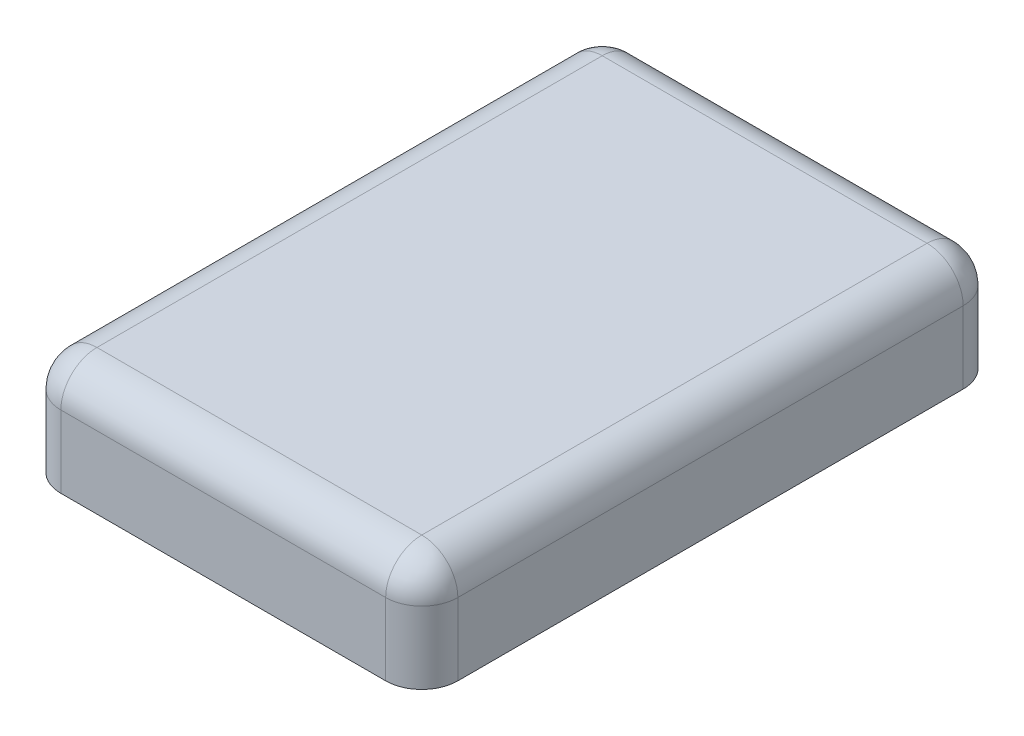
ISO-10303-21;
HEADER;
FILE_DESCRIPTION(('STEP AP214'),'2;1');
FILE_NAME('part.step','',(''),(''),'','','');
FILE_SCHEMA(('AUTOMOTIVE_DESIGN { 1 0 10303 214 1 1 1 1 }'));
ENDSEC;
DATA;
#1=APPLICATION_CONTEXT('core data for automotive mechanical design processes');
#2=APPLICATION_PROTOCOL_DEFINITION('international standard','automotive_design',2000,#1);
#3=PRODUCT_CONTEXT('',#1,'mechanical');
#4=PRODUCT('Part','Part','',(#3));
#5=PRODUCT_RELATED_PRODUCT_CATEGORY('part','',(#4));
#6=PRODUCT_DEFINITION_FORMATION('','',#4);
#7=PRODUCT_DEFINITION_CONTEXT('part definition',#1,'design');
#8=PRODUCT_DEFINITION('design','',#6,#7);
#9=PRODUCT_DEFINITION_SHAPE('','',#8);
#10=(LENGTH_UNIT() NAMED_UNIT(*) SI_UNIT(.MILLI.,.METRE.));
#11=(NAMED_UNIT(*) PLANE_ANGLE_UNIT() SI_UNIT($,.RADIAN.));
#12=(NAMED_UNIT(*) SI_UNIT($,.STERADIAN.) SOLID_ANGLE_UNIT());
#13=UNCERTAINTY_MEASURE_WITH_UNIT(LENGTH_MEASURE(1.E-05),#10,'distance_accuracy_value','');
#14=(GEOMETRIC_REPRESENTATION_CONTEXT(3) GLOBAL_UNCERTAINTY_ASSIGNED_CONTEXT((#13)) GLOBAL_UNIT_ASSIGNED_CONTEXT((#10,
#11,#12)) REPRESENTATION_CONTEXT('',''));
#15=CARTESIAN_POINT('',(0.,0.,0.));
#16=DIRECTION('',(0.,0.,1.));
#17=DIRECTION('',(1.,0.,0.));
#18=AXIS2_PLACEMENT_3D('',#15,#16,#17);
#19=CARTESIAN_POINT('',(1.1,0.6,-1.6));
#20=DIRECTION('',(-1.,0.,0.));
#21=DIRECTION('',(0.,0.,1.));
#22=AXIS2_PLACEMENT_3D('',#19,#20,#21);
#23=PLANE('',#22);
#24=DIRECTION('',(0.,-1.,0.));
#25=VECTOR('',#24,1.);
#26=CARTESIAN_POINT('',(1.1,0.6,-1.4));
#27=LINE('',#26,#25);
#28=CARTESIAN_POINT('',(1.1,0.,-1.4));
#29=VERTEX_POINT('',#28);
#30=CARTESIAN_POINT('',(1.1,0.4,-1.4));
#31=VERTEX_POINT('',#30);
#32=EDGE_CURVE('E120',#29,#31,#27,.F.);
#33=ORIENTED_EDGE('',*,*,#32,.T.);
#34=DIRECTION('',(0.,0.,-1.));
#35=VECTOR('',#34,1.);
#36=CARTESIAN_POINT('',(1.1,0.4,1.4));
#37=LINE('',#36,#35);
#38=CARTESIAN_POINT('',(1.1,0.4,1.4));
#39=VERTEX_POINT('',#38);
#40=EDGE_CURVE('E60',#31,#39,#37,.F.);
#41=ORIENTED_EDGE('',*,*,#40,.T.);
#42=DIRECTION('',(0.,-1.,0.));
#43=VECTOR('',#42,1.);
#44=CARTESIAN_POINT('',(1.1,0.6,1.4));
#45=LINE('',#44,#43);
#46=CARTESIAN_POINT('',(1.1,0.,1.4));
#47=VERTEX_POINT('',#46);
#48=EDGE_CURVE('E113',#39,#47,#45,.T.);
#49=ORIENTED_EDGE('',*,*,#48,.T.);
#50=DIRECTION('',(0.,0.,-1.));
#51=VECTOR('',#50,1.);
#52=CARTESIAN_POINT('',(1.1,0.,-1.6));
#53=LINE('',#52,#51);
#54=EDGE_CURVE('E116',#47,#29,#53,.T.);
#55=ORIENTED_EDGE('',*,*,#54,.T.);
#56=EDGE_LOOP('',(#33,#41,#49,#55));
#57=FACE_BOUND('',#56,.T.);
#58=ADVANCED_FACE('F36',(#57),#23,.F.);
#59=CARTESIAN_POINT('',(-1.1,0.6,-1.6));
#60=DIRECTION('',(0.,0.,1.));
#61=DIRECTION('',(1.,0.,0.));
#62=AXIS2_PLACEMENT_3D('',#59,#60,#61);
#63=PLANE('',#62);
#64=DIRECTION('',(0.,-1.,0.));
#65=VECTOR('',#64,1.);
#66=CARTESIAN_POINT('',(-0.9,0.6,-1.6));
#67=LINE('',#66,#65);
#68=CARTESIAN_POINT('',(-0.9,0.,-1.6));
#69=VERTEX_POINT('',#68);
#70=CARTESIAN_POINT('',(-0.9,0.4,-1.6));
#71=VERTEX_POINT('',#70);
#72=EDGE_CURVE('E153',#69,#71,#67,.F.);
#73=ORIENTED_EDGE('',*,*,#72,.T.);
#74=DIRECTION('',(-1.,0.,0.));
#75=VECTOR('',#74,1.);
#76=CARTESIAN_POINT('',(0.9,0.4,-1.6));
#77=LINE('',#76,#75);
#78=CARTESIAN_POINT('',(0.9,0.4,-1.6));
#79=VERTEX_POINT('',#78);
#80=EDGE_CURVE('E179',#71,#79,#77,.F.);
#81=ORIENTED_EDGE('',*,*,#80,.T.);
#82=DIRECTION('',(0.,-1.,0.));
#83=VECTOR('',#82,1.);
#84=CARTESIAN_POINT('',(0.9,0.6,-1.6));
#85=LINE('',#84,#83);
#86=CARTESIAN_POINT('',(0.9,0.,-1.6));
#87=VERTEX_POINT('',#86);
#88=EDGE_CURVE('E156',#79,#87,#85,.T.);
#89=ORIENTED_EDGE('',*,*,#88,.T.);
#90=DIRECTION('',(-1.,0.,0.));
#91=VECTOR('',#90,1.);
#92=CARTESIAN_POINT('',(-1.1,0.,-1.6));
#93=LINE('',#92,#91);
#94=EDGE_CURVE('E134',#87,#69,#93,.T.);
#95=ORIENTED_EDGE('',*,*,#94,.T.);
#96=EDGE_LOOP('',(#73,#81,#89,#95));
#97=FACE_BOUND('',#96,.T.);
#98=ADVANCED_FACE('F238',(#97),#63,.F.);
#99=CARTESIAN_POINT('',(-1.1,0.6,-1.6));
#100=DIRECTION('',(1.,0.,0.));
#101=DIRECTION('',(0.,0.,-1.));
#102=AXIS2_PLACEMENT_3D('',#99,#100,#101);
#103=PLANE('',#102);
#104=DIRECTION('',(0.,-1.,0.));
#105=VECTOR('',#104,1.);
#106=CARTESIAN_POINT('',(-1.1,0.6,1.4));
#107=LINE('',#106,#105);
#108=CARTESIAN_POINT('',(-1.1,0.,1.4));
#109=VERTEX_POINT('',#108);
#110=CARTESIAN_POINT('',(-1.1,0.4,1.4));
#111=VERTEX_POINT('',#110);
#112=EDGE_CURVE('E160',#109,#111,#107,.F.);
#113=ORIENTED_EDGE('',*,*,#112,.T.);
#114=DIRECTION('',(0.,0.,1.));
#115=VECTOR('',#114,1.);
#116=CARTESIAN_POINT('',(-1.1,0.4,-1.4));
#117=LINE('',#116,#115);
#118=CARTESIAN_POINT('',(-1.1,0.4,-1.4));
#119=VERTEX_POINT('',#118);
#120=EDGE_CURVE('E175',#111,#119,#117,.F.);
#121=ORIENTED_EDGE('',*,*,#120,.T.);
#122=DIRECTION('',(0.,-1.,0.));
#123=VECTOR('',#122,1.);
#124=CARTESIAN_POINT('',(-1.1,0.6,-1.4));
#125=LINE('',#124,#123);
#126=CARTESIAN_POINT('',(-1.1,0.,-1.4));
#127=VERTEX_POINT('',#126);
#128=EDGE_CURVE('E158',#119,#127,#125,.T.);
#129=ORIENTED_EDGE('',*,*,#128,.T.);
#130=DIRECTION('',(0.,0.,1.));
#131=VECTOR('',#130,1.);
#132=CARTESIAN_POINT('',(-1.1,0.,-1.6));
#133=LINE('',#132,#131);
#134=EDGE_CURVE('E137',#127,#109,#133,.T.);
#135=ORIENTED_EDGE('',*,*,#134,.T.);
#136=EDGE_LOOP('',(#113,#121,#129,#135));
#137=FACE_BOUND('',#136,.T.);
#138=ADVANCED_FACE('F243',(#137),#103,.F.);
#139=CARTESIAN_POINT('',(-1.1,0.6,1.6));
#140=DIRECTION('',(0.,0.,-1.));
#141=DIRECTION('',(-1.,0.,0.));
#142=AXIS2_PLACEMENT_3D('',#139,#140,#141);
#143=PLANE('',#142);
#144=DIRECTION('',(0.,-1.,0.));
#145=VECTOR('',#144,1.);
#146=CARTESIAN_POINT('',(0.9,0.6,1.6));
#147=LINE('',#146,#145);
#148=CARTESIAN_POINT('',(0.9,0.,1.6));
#149=VERTEX_POINT('',#148);
#150=CARTESIAN_POINT('',(0.9,0.4,1.6));
#151=VERTEX_POINT('',#150);
#152=EDGE_CURVE('E124',#149,#151,#147,.F.);
#153=ORIENTED_EDGE('',*,*,#152,.T.);
#154=DIRECTION('',(1.,0.,0.));
#155=VECTOR('',#154,1.);
#156=CARTESIAN_POINT('',(-0.9,0.4,1.6));
#157=LINE('',#156,#155);
#158=CARTESIAN_POINT('',(-0.9,0.4,1.6));
#159=VERTEX_POINT('',#158);
#160=EDGE_CURVE('E11',#151,#159,#157,.F.);
#161=ORIENTED_EDGE('',*,*,#160,.T.);
#162=DIRECTION('',(0.,-1.,0.));
#163=VECTOR('',#162,1.);
#164=CARTESIAN_POINT('',(-0.9,0.6,1.6));
#165=LINE('',#164,#163);
#166=CARTESIAN_POINT('',(-0.9,0.,1.6));
#167=VERTEX_POINT('',#166);
#168=EDGE_CURVE('E128',#159,#167,#165,.T.);
#169=ORIENTED_EDGE('',*,*,#168,.T.);
#170=DIRECTION('',(1.,0.,0.));
#171=VECTOR('',#170,1.);
#172=CARTESIAN_POINT('',(-1.1,0.,1.6));
#173=LINE('',#172,#171);
#174=EDGE_CURVE('E144',#167,#149,#173,.T.);
#175=ORIENTED_EDGE('',*,*,#174,.T.);
#176=EDGE_LOOP('',(#153,#161,#169,#175));
#177=FACE_BOUND('',#176,.T.);
#178=ADVANCED_FACE('F354',(#177),#143,.F.);
#179=CARTESIAN_POINT('',(0.,0.6,0.));
#180=DIRECTION('',(0.,1.,0.));
#181=DIRECTION('',(0.,0.,1.));
#182=AXIS2_PLACEMENT_3D('',#179,#180,#181);
#183=PLANE('',#182);
#184=DIRECTION('',(-1.,0.,0.));
#185=VECTOR('',#184,1.);
#186=CARTESIAN_POINT('',(-0.9,0.6,-1.4));
#187=LINE('',#186,#185);
#188=CARTESIAN_POINT('',(0.9,0.6,-1.4));
#189=VERTEX_POINT('',#188);
#190=CARTESIAN_POINT('',(-0.9,0.6,-1.4));
#191=VERTEX_POINT('',#190);
#192=EDGE_CURVE('E170',#189,#191,#187,.T.);
#193=ORIENTED_EDGE('',*,*,#192,.T.);
#194=DIRECTION('',(0.,0.,1.));
#195=VECTOR('',#194,1.);
#196=CARTESIAN_POINT('',(-0.9,0.6,1.4));
#197=LINE('',#196,#195);
#198=CARTESIAN_POINT('',(-0.9,0.6,1.4));
#199=VERTEX_POINT('',#198);
#200=EDGE_CURVE('E172',#191,#199,#197,.T.);
#201=ORIENTED_EDGE('',*,*,#200,.T.);
#202=DIRECTION('',(1.,0.,0.));
#203=VECTOR('',#202,1.);
#204=CARTESIAN_POINT('',(0.9,0.6,1.4));
#205=LINE('',#204,#203);
#206=CARTESIAN_POINT('',(0.9,0.6,1.4));
#207=VERTEX_POINT('',#206);
#208=EDGE_CURVE('E166',#199,#207,#205,.T.);
#209=ORIENTED_EDGE('',*,*,#208,.T.);
#210=DIRECTION('',(0.,0.,-1.));
#211=VECTOR('',#210,1.);
#212=CARTESIAN_POINT('',(0.9,0.6,-1.4));
#213=LINE('',#212,#211);
#214=EDGE_CURVE('E168',#207,#189,#213,.T.);
#215=ORIENTED_EDGE('',*,*,#214,.T.);
#216=EDGE_LOOP('',(#193,#201,#209,#215));
#217=FACE_BOUND('',#216,.T.);
#218=ADVANCED_FACE('F215',(#217),#183,.T.);
#219=CARTESIAN_POINT('',(0.,0.,0.));
#220=DIRECTION('',(0.,1.,0.));
#221=DIRECTION('',(0.,0.,1.));
#222=AXIS2_PLACEMENT_3D('',#219,#220,#221);
#223=PLANE('',#222);
#224=ORIENTED_EDGE('',*,*,#54,.F.);
#225=CARTESIAN_POINT('',(0.9,0.,1.4));
#226=DIRECTION('',(0.,1.,0.));
#227=DIRECTION('',(0.,0.,1.));
#228=AXIS2_PLACEMENT_3D('',#225,#226,#227);
#229=CIRCLE('',#228,0.2);
#230=EDGE_CURVE('E122',#47,#149,#229,.F.);
#231=ORIENTED_EDGE('',*,*,#230,.T.);
#232=ORIENTED_EDGE('',*,*,#174,.F.);
#233=CARTESIAN_POINT('',(-0.9,0.,1.4));
#234=DIRECTION('',(0.,1.,0.));
#235=DIRECTION('',(0.,0.,1.));
#236=AXIS2_PLACEMENT_3D('',#233,#234,#235);
#237=CIRCLE('',#236,0.2);
#238=EDGE_CURVE('E148',#167,#109,#237,.F.);
#239=ORIENTED_EDGE('',*,*,#238,.T.);
#240=ORIENTED_EDGE('',*,*,#134,.F.);
#241=CARTESIAN_POINT('',(-0.9,0.,-1.4));
#242=DIRECTION('',(0.,1.,0.));
#243=DIRECTION('',(0.,0.,1.));
#244=AXIS2_PLACEMENT_3D('',#241,#242,#243);
#245=CIRCLE('',#244,0.2);
#246=EDGE_CURVE('E119',#127,#69,#245,.F.);
#247=ORIENTED_EDGE('',*,*,#246,.T.);
#248=ORIENTED_EDGE('',*,*,#94,.F.);
#249=CARTESIAN_POINT('',(0.9,0.,-1.4));
#250=DIRECTION('',(0.,1.,0.));
#251=DIRECTION('',(0.,0.,1.));
#252=AXIS2_PLACEMENT_3D('',#249,#250,#251);
#253=CIRCLE('',#252,0.2);
#254=EDGE_CURVE('E129',#87,#29,#253,.F.);
#255=ORIENTED_EDGE('',*,*,#254,.T.);
#256=EDGE_LOOP('',(#224,#231,#232,#239,#240,#247,#248,#255));
#257=FACE_BOUND('',#256,.T.);
#258=ADVANCED_FACE('F131',(#257),#223,.F.);
#259=CARTESIAN_POINT('',(0.9,0.6,1.4));
#260=DIRECTION('',(0.,-1.,0.));
#261=DIRECTION('',(0.,0.,-1.));
#262=AXIS2_PLACEMENT_3D('',#259,#260,#261);
#263=CYLINDRICAL_SURFACE('',#262,0.2);
#264=ORIENTED_EDGE('',*,*,#48,.F.);
#265=CARTESIAN_POINT('',(0.9,0.4,1.4));
#266=DIRECTION('',(0.,-1.,0.));
#267=DIRECTION('',(0.,0.,-1.));
#268=AXIS2_PLACEMENT_3D('',#265,#266,#267);
#269=CIRCLE('',#268,0.2);
#270=EDGE_CURVE('E45',#39,#151,#269,.T.);
#271=ORIENTED_EDGE('',*,*,#270,.T.);
#272=ORIENTED_EDGE('',*,*,#152,.F.);
#273=ORIENTED_EDGE('',*,*,#230,.F.);
#274=EDGE_LOOP('',(#264,#271,#272,#273));
#275=FACE_BOUND('',#274,.T.);
#276=ADVANCED_FACE('F123',(#275),#263,.T.);
#277=CARTESIAN_POINT('',(0.9,0.6,-1.4));
#278=DIRECTION('',(0.,-1.,0.));
#279=DIRECTION('',(0.,0.,-1.));
#280=AXIS2_PLACEMENT_3D('',#277,#278,#279);
#281=CYLINDRICAL_SURFACE('',#280,0.2);
#282=ORIENTED_EDGE('',*,*,#88,.F.);
#283=CARTESIAN_POINT('',(0.9,0.4,-1.4));
#284=DIRECTION('',(0.,-1.,0.));
#285=DIRECTION('',(0.,0.,-1.));
#286=AXIS2_PLACEMENT_3D('',#283,#284,#285);
#287=CIRCLE('',#286,0.2);
#288=EDGE_CURVE('E181',#79,#31,#287,.T.);
#289=ORIENTED_EDGE('',*,*,#288,.T.);
#290=ORIENTED_EDGE('',*,*,#32,.F.);
#291=ORIENTED_EDGE('',*,*,#254,.F.);
#292=EDGE_LOOP('',(#282,#289,#290,#291));
#293=FACE_BOUND('',#292,.T.);
#294=ADVANCED_FACE('F250',(#293),#281,.T.);
#295=CARTESIAN_POINT('',(-0.9,0.6,1.4));
#296=DIRECTION('',(0.,-1.,0.));
#297=DIRECTION('',(0.,0.,-1.));
#298=AXIS2_PLACEMENT_3D('',#295,#296,#297);
#299=CYLINDRICAL_SURFACE('',#298,0.2);
#300=ORIENTED_EDGE('',*,*,#168,.F.);
#301=CARTESIAN_POINT('',(-0.9,0.4,1.4));
#302=DIRECTION('',(0.,-1.,0.));
#303=DIRECTION('',(0.,0.,-1.));
#304=AXIS2_PLACEMENT_3D('',#301,#302,#303);
#305=CIRCLE('',#304,0.2);
#306=EDGE_CURVE('E163',#159,#111,#305,.T.);
#307=ORIENTED_EDGE('',*,*,#306,.T.);
#308=ORIENTED_EDGE('',*,*,#112,.F.);
#309=ORIENTED_EDGE('',*,*,#238,.F.);
#310=EDGE_LOOP('',(#300,#307,#308,#309));
#311=FACE_BOUND('',#310,.T.);
#312=ADVANCED_FACE('F253',(#311),#299,.T.);
#313=CARTESIAN_POINT('',(-0.9,0.6,-1.4));
#314=DIRECTION('',(0.,-1.,0.));
#315=DIRECTION('',(0.,0.,-1.));
#316=AXIS2_PLACEMENT_3D('',#313,#314,#315);
#317=CYLINDRICAL_SURFACE('',#316,0.2);
#318=ORIENTED_EDGE('',*,*,#128,.F.);
#319=CARTESIAN_POINT('',(-0.9,0.4,-1.4));
#320=DIRECTION('',(0.,-1.,0.));
#321=DIRECTION('',(0.,0.,-1.));
#322=AXIS2_PLACEMENT_3D('',#319,#320,#321);
#323=CIRCLE('',#322,0.2);
#324=EDGE_CURVE('E177',#119,#71,#323,.T.);
#325=ORIENTED_EDGE('',*,*,#324,.T.);
#326=ORIENTED_EDGE('',*,*,#72,.F.);
#327=ORIENTED_EDGE('',*,*,#246,.F.);
#328=EDGE_LOOP('',(#318,#325,#326,#327));
#329=FACE_BOUND('',#328,.T.);
#330=ADVANCED_FACE('F257',(#329),#317,.T.);
#331=CARTESIAN_POINT('',(0.9,0.4,-1.4));
#332=DIRECTION('',(0.,1.,0.));
#333=DIRECTION('',(0.,0.,1.));
#334=AXIS2_PLACEMENT_3D('',#331,#332,#333);
#335=SPHERICAL_SURFACE('',#334,0.2);
#336=CARTESIAN_POINT('',(0.9,0.4,-1.4));
#337=DIRECTION('',(0.,0.,1.));
#338=DIRECTION('',(1.,0.,0.));
#339=AXIS2_PLACEMENT_3D('',#336,#337,#338);
#340=CIRCLE('',#339,0.2);
#341=EDGE_CURVE('E140',#31,#189,#340,.T.);
#342=ORIENTED_EDGE('',*,*,#341,.F.);
#343=ORIENTED_EDGE('',*,*,#288,.F.);
#344=CARTESIAN_POINT('',(0.9,0.4,-1.4));
#345=DIRECTION('',(-1.,0.,0.));
#346=DIRECTION('',(0.,0.,1.));
#347=AXIS2_PLACEMENT_3D('',#344,#345,#346);
#348=CIRCLE('',#347,0.2);
#349=EDGE_CURVE('E40',#189,#79,#348,.T.);
#350=ORIENTED_EDGE('',*,*,#349,.F.);
#351=EDGE_LOOP('',(#342,#343,#350));
#352=FACE_BOUND('',#351,.T.);
#353=ADVANCED_FACE('F38',(#352),#335,.T.);
#354=CARTESIAN_POINT('',(0.,0.4,-1.4));
#355=DIRECTION('',(1.,0.,0.));
#356=DIRECTION('',(0.,0.,-1.));
#357=AXIS2_PLACEMENT_3D('',#354,#355,#356);
#358=CYLINDRICAL_SURFACE('',#357,0.2);
#359=ORIENTED_EDGE('',*,*,#349,.T.);
#360=ORIENTED_EDGE('',*,*,#80,.F.);
#361=CARTESIAN_POINT('',(-0.9,0.4,-1.4));
#362=DIRECTION('',(-1.,0.,0.));
#363=DIRECTION('',(0.,0.,1.));
#364=AXIS2_PLACEMENT_3D('',#361,#362,#363);
#365=CIRCLE('',#364,0.2);
#366=EDGE_CURVE('E198',#191,#71,#365,.T.);
#367=ORIENTED_EDGE('',*,*,#366,.F.);
#368=ORIENTED_EDGE('',*,*,#192,.F.);
#369=EDGE_LOOP('',(#359,#360,#367,#368));
#370=FACE_BOUND('',#369,.T.);
#371=ADVANCED_FACE('F212',(#370),#358,.T.);
#372=CARTESIAN_POINT('',(0.9,0.4,0.));
#373=DIRECTION('',(0.,0.,1.));
#374=DIRECTION('',(1.,0.,0.));
#375=AXIS2_PLACEMENT_3D('',#372,#373,#374);
#376=CYLINDRICAL_SURFACE('',#375,0.2);
#377=ORIENTED_EDGE('',*,*,#341,.T.);
#378=ORIENTED_EDGE('',*,*,#214,.F.);
#379=CARTESIAN_POINT('',(0.9,0.4,1.4));
#380=DIRECTION('',(0.,0.,1.));
#381=DIRECTION('',(1.,0.,0.));
#382=AXIS2_PLACEMENT_3D('',#379,#380,#381);
#383=CIRCLE('',#382,0.2);
#384=EDGE_CURVE('E195',#39,#207,#383,.T.);
#385=ORIENTED_EDGE('',*,*,#384,.F.);
#386=ORIENTED_EDGE('',*,*,#40,.F.);
#387=EDGE_LOOP('',(#377,#378,#385,#386));
#388=FACE_BOUND('',#387,.T.);
#389=ADVANCED_FACE('F205',(#388),#376,.T.);
#390=CARTESIAN_POINT('',(-0.9,0.4,-1.4));
#391=DIRECTION('',(0.,1.,0.));
#392=DIRECTION('',(0.,0.,1.));
#393=AXIS2_PLACEMENT_3D('',#390,#391,#392);
#394=SPHERICAL_SURFACE('',#393,0.2);
#395=ORIENTED_EDGE('',*,*,#366,.T.);
#396=ORIENTED_EDGE('',*,*,#324,.F.);
#397=CARTESIAN_POINT('',(-0.9,0.4,-1.4));
#398=DIRECTION('',(0.,0.,1.));
#399=DIRECTION('',(1.,0.,0.));
#400=AXIS2_PLACEMENT_3D('',#397,#398,#399);
#401=CIRCLE('',#400,0.2);
#402=EDGE_CURVE('E192',#191,#119,#401,.T.);
#403=ORIENTED_EDGE('',*,*,#402,.F.);
#404=EDGE_LOOP('',(#395,#396,#403));
#405=FACE_BOUND('',#404,.T.);
#406=ADVANCED_FACE('F227',(#405),#394,.T.);
#407=CARTESIAN_POINT('',(0.9,0.4,1.4));
#408=DIRECTION('',(0.,1.,0.));
#409=DIRECTION('',(0.,0.,1.));
#410=AXIS2_PLACEMENT_3D('',#407,#408,#409);
#411=SPHERICAL_SURFACE('',#410,0.2);
#412=ORIENTED_EDGE('',*,*,#270,.F.);
#413=ORIENTED_EDGE('',*,*,#384,.T.);
#414=CARTESIAN_POINT('',(0.9,0.4,1.4));
#415=DIRECTION('',(-1.,0.,0.));
#416=DIRECTION('',(0.,0.,1.));
#417=AXIS2_PLACEMENT_3D('',#414,#415,#416);
#418=CIRCLE('',#417,0.2);
#419=EDGE_CURVE('E189',#151,#207,#418,.T.);
#420=ORIENTED_EDGE('',*,*,#419,.F.);
#421=EDGE_LOOP('',(#412,#413,#420));
#422=FACE_BOUND('',#421,.T.);
#423=ADVANCED_FACE('F224',(#422),#411,.T.);
#424=CARTESIAN_POINT('',(-0.9,0.4,0.));
#425=DIRECTION('',(0.,0.,-1.));
#426=DIRECTION('',(-1.,0.,0.));
#427=AXIS2_PLACEMENT_3D('',#424,#425,#426);
#428=CYLINDRICAL_SURFACE('',#427,0.2);
#429=ORIENTED_EDGE('',*,*,#402,.T.);
#430=ORIENTED_EDGE('',*,*,#120,.F.);
#431=CARTESIAN_POINT('',(-0.9,0.4,1.4));
#432=DIRECTION('',(0.,0.,1.));
#433=DIRECTION('',(1.,0.,0.));
#434=AXIS2_PLACEMENT_3D('',#431,#432,#433);
#435=CIRCLE('',#434,0.2);
#436=EDGE_CURVE('E187',#199,#111,#435,.T.);
#437=ORIENTED_EDGE('',*,*,#436,.F.);
#438=ORIENTED_EDGE('',*,*,#200,.F.);
#439=EDGE_LOOP('',(#429,#430,#437,#438));
#440=FACE_BOUND('',#439,.T.);
#441=ADVANCED_FACE('F226',(#440),#428,.T.);
#442=CARTESIAN_POINT('',(0.,0.4,1.4));
#443=DIRECTION('',(-1.,0.,0.));
#444=DIRECTION('',(0.,0.,1.));
#445=AXIS2_PLACEMENT_3D('',#442,#443,#444);
#446=CYLINDRICAL_SURFACE('',#445,0.2);
#447=ORIENTED_EDGE('',*,*,#419,.T.);
#448=ORIENTED_EDGE('',*,*,#208,.F.);
#449=CARTESIAN_POINT('',(-0.9,0.4,1.4));
#450=DIRECTION('',(-1.,0.,0.));
#451=DIRECTION('',(0.,0.,1.));
#452=AXIS2_PLACEMENT_3D('',#449,#450,#451);
#453=CIRCLE('',#452,0.2);
#454=EDGE_CURVE('E185',#159,#199,#453,.T.);
#455=ORIENTED_EDGE('',*,*,#454,.F.);
#456=ORIENTED_EDGE('',*,*,#160,.F.);
#457=EDGE_LOOP('',(#447,#448,#455,#456));
#458=FACE_BOUND('',#457,.T.);
#459=ADVANCED_FACE('F220',(#458),#446,.T.);
#460=CARTESIAN_POINT('',(-0.9,0.4,1.4));
#461=DIRECTION('',(0.,1.,0.));
#462=DIRECTION('',(0.,0.,1.));
#463=AXIS2_PLACEMENT_3D('',#460,#461,#462);
#464=SPHERICAL_SURFACE('',#463,0.2);
#465=ORIENTED_EDGE('',*,*,#436,.T.);
#466=ORIENTED_EDGE('',*,*,#306,.F.);
#467=ORIENTED_EDGE('',*,*,#454,.T.);
#468=EDGE_LOOP('',(#465,#466,#467));
#469=FACE_BOUND('',#468,.T.);
#470=ADVANCED_FACE('F262',(#469),#464,.T.);
#471=CLOSED_SHELL('',(#58,#98,#138,#178,#218,#258,#276,#294,#312,#330,#353,#371,#389,#406,#423,
#441,#459,#470));
#472=MANIFOLD_SOLID_BREP('B2',#471);
#473=ADVANCED_BREP_SHAPE_REPRESENTATION('',(#18,#472),#14);
#474=SHAPE_DEFINITION_REPRESENTATION(#9,#473);
ENDSEC;
END-ISO-10303-21;
